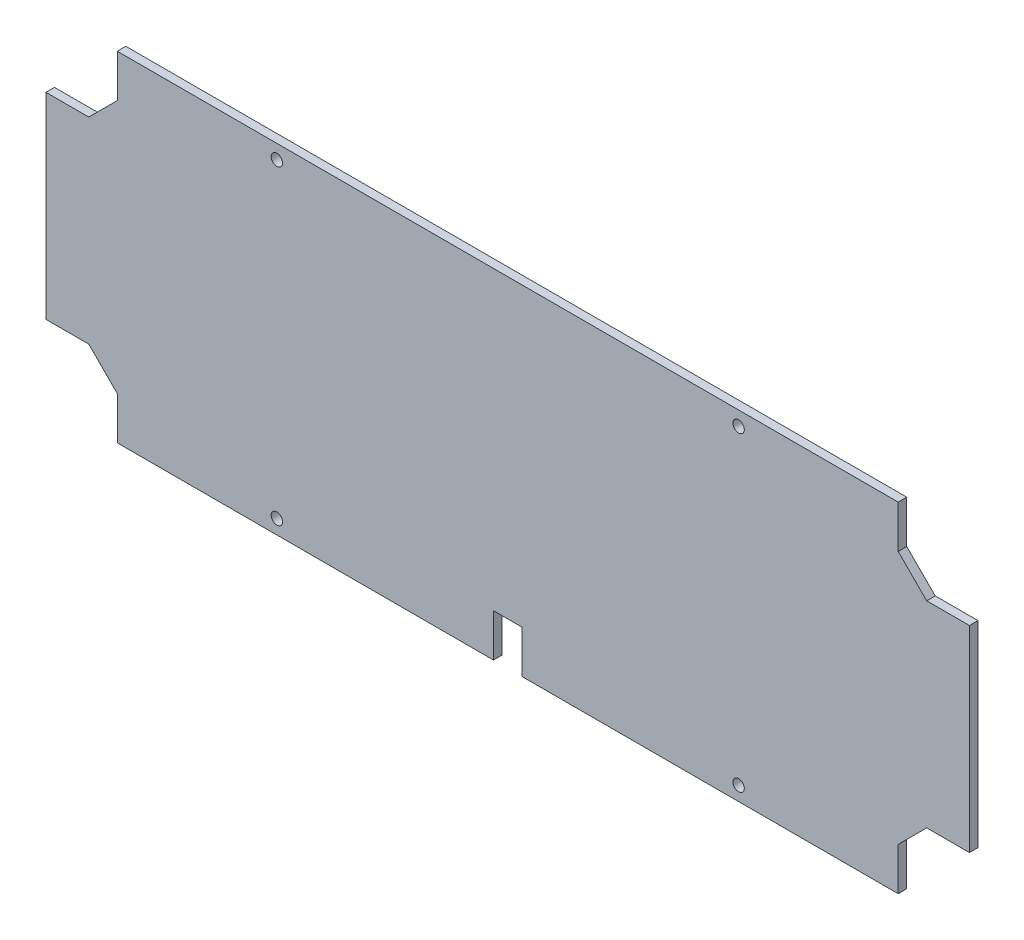
ISO-10303-21;
HEADER;
FILE_DESCRIPTION(('STEP AP214'),'2;1');
FILE_NAME('part.step','',(''),(''),'','','');
FILE_SCHEMA(('AUTOMOTIVE_DESIGN { 1 0 10303 214 1 1 1 1 }'));
ENDSEC;
DATA;
#1=APPLICATION_CONTEXT('core data for automotive mechanical design processes');
#2=APPLICATION_PROTOCOL_DEFINITION('international standard','automotive_design',2000,#1);
#3=PRODUCT_CONTEXT('',#1,'mechanical');
#4=PRODUCT('Part','Part','',(#3));
#5=PRODUCT_RELATED_PRODUCT_CATEGORY('part','',(#4));
#6=PRODUCT_DEFINITION_FORMATION('','',#4);
#7=PRODUCT_DEFINITION_CONTEXT('part definition',#1,'design');
#8=PRODUCT_DEFINITION('design','',#6,#7);
#9=PRODUCT_DEFINITION_SHAPE('','',#8);
#10=(LENGTH_UNIT() NAMED_UNIT(*) SI_UNIT(.MILLI.,.METRE.));
#11=(NAMED_UNIT(*) PLANE_ANGLE_UNIT() SI_UNIT($,.RADIAN.));
#12=(NAMED_UNIT(*) SI_UNIT($,.STERADIAN.) SOLID_ANGLE_UNIT());
#13=UNCERTAINTY_MEASURE_WITH_UNIT(LENGTH_MEASURE(1.E-05),#10,'distance_accuracy_value','');
#14=(GEOMETRIC_REPRESENTATION_CONTEXT(3) GLOBAL_UNCERTAINTY_ASSIGNED_CONTEXT((#13)) GLOBAL_UNIT_ASSIGNED_CONTEXT((#10,
#11,#12)) REPRESENTATION_CONTEXT('',''));
#15=CARTESIAN_POINT('',(0.,0.,0.));
#16=DIRECTION('',(0.,0.,1.));
#17=DIRECTION('',(1.,0.,0.));
#18=AXIS2_PLACEMENT_3D('',#15,#16,#17);
#19=CARTESIAN_POINT('',(0.,0.,3.));
#20=DIRECTION('',(0.,1.,0.));
#21=DIRECTION('',(0.,0.,1.));
#22=AXIS2_PLACEMENT_3D('',#19,#20,#21);
#23=PLANE('',#22);
#24=DIRECTION('',(1.,0.,0.));
#25=VECTOR('',#24,1.);
#26=CARTESIAN_POINT('',(0.,0.,3.));
#27=LINE('',#26,#25);
#28=CARTESIAN_POINT('',(167.,0.,3.));
#29=VERTEX_POINT('',#28);
#30=CARTESIAN_POINT('',(299.,0.,3.));
#31=VERTEX_POINT('',#30);
#32=EDGE_CURVE('E123',#29,#31,#27,.T.);
#33=ORIENTED_EDGE('',*,*,#32,.F.);
#34=DIRECTION('',(0.,0.,1.));
#35=VECTOR('',#34,1.);
#36=CARTESIAN_POINT('',(167.,0.,0.));
#37=LINE('',#36,#35);
#38=CARTESIAN_POINT('',(167.,0.,0.));
#39=VERTEX_POINT('',#38);
#40=EDGE_CURVE('E355',#39,#29,#37,.T.);
#41=ORIENTED_EDGE('',*,*,#40,.F.);
#42=DIRECTION('',(1.,0.,0.));
#43=VECTOR('',#42,1.);
#44=CARTESIAN_POINT('',(0.,0.,0.));
#45=LINE('',#44,#43);
#46=CARTESIAN_POINT('',(299.,0.,0.));
#47=VERTEX_POINT('',#46);
#48=EDGE_CURVE('E210',#39,#47,#45,.T.);
#49=ORIENTED_EDGE('',*,*,#48,.T.);
#50=DIRECTION('',(0.,0.,-1.));
#51=VECTOR('',#50,1.);
#52=CARTESIAN_POINT('',(299.,0.,3.));
#53=LINE('',#52,#51);
#54=EDGE_CURVE('E11',#31,#47,#53,.T.);
#55=ORIENTED_EDGE('',*,*,#54,.F.);
#56=EDGE_LOOP('',(#33,#41,#49,#55));
#57=FACE_BOUND('',#56,.T.);
#58=ADVANCED_FACE('F35',(#57),#23,.F.);
#59=CARTESIAN_POINT('',(25.,0.,0.));
#60=VERTEX_POINT('',#59);
#61=CARTESIAN_POINT('',(157.,0.,0.));
#62=VERTEX_POINT('',#61);
#63=EDGE_CURVE('E207',#60,#62,#45,.T.);
#64=ORIENTED_EDGE('',*,*,#63,.T.);
#65=DIRECTION('',(0.,0.,1.));
#66=VECTOR('',#65,1.);
#67=CARTESIAN_POINT('',(157.,0.,0.));
#68=LINE('',#67,#66);
#69=CARTESIAN_POINT('',(157.,0.,3.));
#70=VERTEX_POINT('',#69);
#71=EDGE_CURVE('E50',#62,#70,#68,.T.);
#72=ORIENTED_EDGE('',*,*,#71,.T.);
#73=CARTESIAN_POINT('',(25.,0.,3.));
#74=VERTEX_POINT('',#73);
#75=EDGE_CURVE('E314',#74,#70,#27,.T.);
#76=ORIENTED_EDGE('',*,*,#75,.F.);
#77=DIRECTION('',(0.,0.,-1.));
#78=VECTOR('',#77,1.);
#79=CARTESIAN_POINT('',(25.,0.,3.));
#80=LINE('',#79,#78);
#81=EDGE_CURVE('E59',#74,#60,#80,.T.);
#82=ORIENTED_EDGE('',*,*,#81,.T.);
#83=EDGE_LOOP('',(#64,#72,#76,#82));
#84=FACE_BOUND('',#83,.T.);
#85=ADVANCED_FACE('F37',(#84),#23,.F.);
#86=CARTESIAN_POINT('',(299.,1.10652228120974E-12,3.));
#87=DIRECTION('',(-1.,0.,0.));
#88=DIRECTION('',(0.,-1.,0.));
#89=AXIS2_PLACEMENT_3D('',#86,#87,#88);
#90=PLANE('',#89);
#91=DIRECTION('',(0.,1.,0.));
#92=VECTOR('',#91,1.);
#93=CARTESIAN_POINT('',(299.,1.10652228120974E-12,0.));
#94=LINE('',#93,#92);
#95=CARTESIAN_POINT('',(299.,14.9999999999999,0.));
#96=VERTEX_POINT('',#95);
#97=EDGE_CURVE('E209',#47,#96,#94,.T.);
#98=ORIENTED_EDGE('',*,*,#97,.T.);
#99=DIRECTION('',(0.,0.,-1.));
#100=VECTOR('',#99,1.);
#101=CARTESIAN_POINT('',(299.,14.9999999999999,3.));
#102=LINE('',#101,#100);
#103=CARTESIAN_POINT('',(299.,14.9999999999999,3.));
#104=VERTEX_POINT('',#103);
#105=EDGE_CURVE('E43',#104,#96,#102,.T.);
#106=ORIENTED_EDGE('',*,*,#105,.F.);
#107=DIRECTION('',(0.,1.,0.));
#108=VECTOR('',#107,1.);
#109=CARTESIAN_POINT('',(299.,1.10652228120974E-12,3.));
#110=LINE('',#109,#108);
#111=EDGE_CURVE('E310',#31,#104,#110,.T.);
#112=ORIENTED_EDGE('',*,*,#111,.F.);
#113=ORIENTED_EDGE('',*,*,#54,.T.);
#114=EDGE_LOOP('',(#98,#106,#112,#113));
#115=FACE_BOUND('',#114,.T.);
#116=ADVANCED_FACE('F295',(#115),#90,.F.);
#117=CARTESIAN_POINT('',(142.,-142.,3.));
#118=DIRECTION('',(0.707106781186547,-0.707106781186548,0.));
#119=DIRECTION('',(0.707106781186548,0.707106781186547,0.));
#120=AXIS2_PLACEMENT_3D('',#117,#118,#119);
#121=PLANE('',#120);
#122=DIRECTION('',(-0.707106781186548,-0.707106781186547,0.));
#123=VECTOR('',#122,1.);
#124=CARTESIAN_POINT('',(142.,-142.,0.));
#125=LINE('',#124,#123);
#126=CARTESIAN_POINT('',(309.,24.9999999999999,0.));
#127=VERTEX_POINT('',#126);
#128=EDGE_CURVE('E213',#127,#96,#125,.T.);
#129=ORIENTED_EDGE('',*,*,#128,.F.);
#130=DIRECTION('',(0.,0.,-1.));
#131=VECTOR('',#130,1.);
#132=CARTESIAN_POINT('',(309.,24.9999999999999,3.));
#133=LINE('',#132,#131);
#134=CARTESIAN_POINT('',(309.,24.9999999999999,3.));
#135=VERTEX_POINT('',#134);
#136=EDGE_CURVE('E285',#135,#127,#133,.T.);
#137=ORIENTED_EDGE('',*,*,#136,.F.);
#138=DIRECTION('',(-0.707106781186548,-0.707106781186547,0.));
#139=VECTOR('',#138,1.);
#140=CARTESIAN_POINT('',(142.,-142.,3.));
#141=LINE('',#140,#139);
#142=EDGE_CURVE('E292',#135,#104,#141,.T.);
#143=ORIENTED_EDGE('',*,*,#142,.T.);
#144=ORIENTED_EDGE('',*,*,#105,.T.);
#145=EDGE_LOOP('',(#129,#137,#143,#144));
#146=FACE_BOUND('',#145,.T.);
#147=ADVANCED_FACE('F290',(#146),#121,.T.);
#148=CARTESIAN_POINT('',(0.,25.0000000000002,3.));
#149=DIRECTION('',(0.,-1.,0.));
#150=DIRECTION('',(1.,0.,0.));
#151=AXIS2_PLACEMENT_3D('',#148,#149,#150);
#152=PLANE('',#151);
#153=DIRECTION('',(-1.,0.,0.));
#154=VECTOR('',#153,1.);
#155=CARTESIAN_POINT('',(0.,25.0000000000002,0.));
#156=LINE('',#155,#154);
#157=CARTESIAN_POINT('',(324.,24.9999999999999,0.));
#158=VERTEX_POINT('',#157);
#159=EDGE_CURVE('E216',#158,#127,#156,.T.);
#160=ORIENTED_EDGE('',*,*,#159,.F.);
#161=DIRECTION('',(0.,0.,-1.));
#162=VECTOR('',#161,1.);
#163=CARTESIAN_POINT('',(324.,24.9999999999999,3.));
#164=LINE('',#163,#162);
#165=CARTESIAN_POINT('',(324.,24.9999999999999,3.));
#166=VERTEX_POINT('',#165);
#167=EDGE_CURVE('E283',#166,#158,#164,.T.);
#168=ORIENTED_EDGE('',*,*,#167,.F.);
#169=DIRECTION('',(-1.,0.,0.));
#170=VECTOR('',#169,1.);
#171=CARTESIAN_POINT('',(0.,25.0000000000002,3.));
#172=LINE('',#171,#170);
#173=EDGE_CURVE('E309',#166,#135,#172,.T.);
#174=ORIENTED_EDGE('',*,*,#173,.T.);
#175=ORIENTED_EDGE('',*,*,#136,.T.);
#176=EDGE_LOOP('',(#160,#168,#174,#175));
#177=FACE_BOUND('',#176,.T.);
#178=ADVANCED_FACE('F305',(#177),#152,.T.);
#179=CARTESIAN_POINT('',(324.,0.,3.));
#180=DIRECTION('',(-1.,0.,0.));
#181=DIRECTION('',(0.,0.,1.));
#182=AXIS2_PLACEMENT_3D('',#179,#180,#181);
#183=PLANE('',#182);
#184=DIRECTION('',(0.,1.,0.));
#185=VECTOR('',#184,1.);
#186=CARTESIAN_POINT('',(324.,0.,0.));
#187=LINE('',#186,#185);
#188=CARTESIAN_POINT('',(324.,94.0000000000001,0.));
#189=VERTEX_POINT('',#188);
#190=EDGE_CURVE('E219',#158,#189,#187,.T.);
#191=ORIENTED_EDGE('',*,*,#190,.T.);
#192=DIRECTION('',(0.,0.,-1.));
#193=VECTOR('',#192,1.);
#194=CARTESIAN_POINT('',(324.,94.0000000000001,3.));
#195=LINE('',#194,#193);
#196=CARTESIAN_POINT('',(324.,94.0000000000001,3.));
#197=VERTEX_POINT('',#196);
#198=EDGE_CURVE('E280',#197,#189,#195,.T.);
#199=ORIENTED_EDGE('',*,*,#198,.F.);
#200=DIRECTION('',(0.,1.,0.));
#201=VECTOR('',#200,1.);
#202=CARTESIAN_POINT('',(324.,0.,3.));
#203=LINE('',#202,#201);
#204=EDGE_CURVE('E312',#166,#197,#203,.T.);
#205=ORIENTED_EDGE('',*,*,#204,.F.);
#206=ORIENTED_EDGE('',*,*,#167,.T.);
#207=EDGE_LOOP('',(#191,#199,#205,#206));
#208=FACE_BOUND('',#207,.T.);
#209=ADVANCED_FACE('F406',(#208),#183,.F.);
#210=CARTESIAN_POINT('',(0.,93.9999999999998,3.));
#211=DIRECTION('',(0.,-1.,0.));
#212=DIRECTION('',(1.,0.,0.));
#213=AXIS2_PLACEMENT_3D('',#210,#211,#212);
#214=PLANE('',#213);
#215=DIRECTION('',(-1.,0.,0.));
#216=VECTOR('',#215,1.);
#217=CARTESIAN_POINT('',(0.,93.9999999999998,0.));
#218=LINE('',#217,#216);
#219=CARTESIAN_POINT('',(309.,94.0000000000001,0.));
#220=VERTEX_POINT('',#219);
#221=EDGE_CURVE('E221',#189,#220,#218,.T.);
#222=ORIENTED_EDGE('',*,*,#221,.T.);
#223=DIRECTION('',(0.,0.,-1.));
#224=VECTOR('',#223,1.);
#225=CARTESIAN_POINT('',(309.,94.0000000000001,3.));
#226=LINE('',#225,#224);
#227=CARTESIAN_POINT('',(309.,94.0000000000001,3.));
#228=VERTEX_POINT('',#227);
#229=EDGE_CURVE('E277',#228,#220,#226,.T.);
#230=ORIENTED_EDGE('',*,*,#229,.F.);
#231=DIRECTION('',(-1.,0.,0.));
#232=VECTOR('',#231,1.);
#233=CARTESIAN_POINT('',(0.,93.9999999999998,3.));
#234=LINE('',#233,#232);
#235=EDGE_CURVE('E319',#197,#228,#234,.T.);
#236=ORIENTED_EDGE('',*,*,#235,.F.);
#237=ORIENTED_EDGE('',*,*,#198,.T.);
#238=EDGE_LOOP('',(#222,#230,#236,#237));
#239=FACE_BOUND('',#238,.T.);
#240=ADVANCED_FACE('F409',(#239),#214,.F.);
#241=CARTESIAN_POINT('',(201.5,201.5,3.));
#242=DIRECTION('',(-0.707106781186547,-0.707106781186548,0.));
#243=DIRECTION('',(0.707106781186548,-0.707106781186547,0.));
#244=AXIS2_PLACEMENT_3D('',#241,#242,#243);
#245=PLANE('',#244);
#246=DIRECTION('',(-0.707106781186548,0.707106781186547,0.));
#247=VECTOR('',#246,1.);
#248=CARTESIAN_POINT('',(201.5,201.5,0.));
#249=LINE('',#248,#247);
#250=CARTESIAN_POINT('',(299.,104.,0.));
#251=VERTEX_POINT('',#250);
#252=EDGE_CURVE('E223',#220,#251,#249,.T.);
#253=ORIENTED_EDGE('',*,*,#252,.T.);
#254=DIRECTION('',(0.,0.,-1.));
#255=VECTOR('',#254,1.);
#256=CARTESIAN_POINT('',(299.,104.,3.));
#257=LINE('',#256,#255);
#258=CARTESIAN_POINT('',(299.,104.,3.));
#259=VERTEX_POINT('',#258);
#260=EDGE_CURVE('E275',#259,#251,#257,.T.);
#261=ORIENTED_EDGE('',*,*,#260,.F.);
#262=DIRECTION('',(-0.707106781186548,0.707106781186547,0.));
#263=VECTOR('',#262,1.);
#264=CARTESIAN_POINT('',(201.5,201.5,3.));
#265=LINE('',#264,#263);
#266=EDGE_CURVE('E321',#228,#259,#265,.T.);
#267=ORIENTED_EDGE('',*,*,#266,.F.);
#268=ORIENTED_EDGE('',*,*,#229,.T.);
#269=EDGE_LOOP('',(#253,#261,#267,#268));
#270=FACE_BOUND('',#269,.T.);
#271=ADVANCED_FACE('F413',(#270),#245,.F.);
#272=CARTESIAN_POINT('',(299.,-1.10652228120974E-12,3.));
#273=DIRECTION('',(1.,0.,0.));
#274=DIRECTION('',(0.,1.,0.));
#275=AXIS2_PLACEMENT_3D('',#272,#273,#274);
#276=PLANE('',#275);
#277=DIRECTION('',(0.,-1.,0.));
#278=VECTOR('',#277,1.);
#279=CARTESIAN_POINT('',(299.,-1.10652228120974E-12,0.));
#280=LINE('',#279,#278);
#281=CARTESIAN_POINT('',(299.,119.,0.));
#282=VERTEX_POINT('',#281);
#283=EDGE_CURVE('E226',#282,#251,#280,.T.);
#284=ORIENTED_EDGE('',*,*,#283,.F.);
#285=DIRECTION('',(0.,0.,-1.));
#286=VECTOR('',#285,1.);
#287=CARTESIAN_POINT('',(299.,119.,3.));
#288=LINE('',#287,#286);
#289=CARTESIAN_POINT('',(299.,119.,3.));
#290=VERTEX_POINT('',#289);
#291=EDGE_CURVE('E273',#290,#282,#288,.T.);
#292=ORIENTED_EDGE('',*,*,#291,.F.);
#293=DIRECTION('',(0.,-1.,0.));
#294=VECTOR('',#293,1.);
#295=CARTESIAN_POINT('',(299.,-1.10652228120974E-12,3.));
#296=LINE('',#295,#294);
#297=EDGE_CURVE('E323',#290,#259,#296,.T.);
#298=ORIENTED_EDGE('',*,*,#297,.T.);
#299=ORIENTED_EDGE('',*,*,#260,.T.);
#300=EDGE_LOOP('',(#284,#292,#298,#299));
#301=FACE_BOUND('',#300,.T.);
#302=ADVANCED_FACE('F417',(#301),#276,.T.);
#303=CARTESIAN_POINT('',(0.,119.,3.));
#304=DIRECTION('',(0.,1.,0.));
#305=DIRECTION('',(0.,0.,1.));
#306=AXIS2_PLACEMENT_3D('',#303,#304,#305);
#307=PLANE('',#306);
#308=DIRECTION('',(1.,0.,0.));
#309=VECTOR('',#308,1.);
#310=CARTESIAN_POINT('',(0.,119.,0.));
#311=LINE('',#310,#309);
#312=CARTESIAN_POINT('',(25.,119.,0.));
#313=VERTEX_POINT('',#312);
#314=EDGE_CURVE('E229',#313,#282,#311,.T.);
#315=ORIENTED_EDGE('',*,*,#314,.F.);
#316=DIRECTION('',(0.,0.,-1.));
#317=VECTOR('',#316,1.);
#318=CARTESIAN_POINT('',(25.,119.,3.));
#319=LINE('',#318,#317);
#320=CARTESIAN_POINT('',(25.,119.,3.));
#321=VERTEX_POINT('',#320);
#322=EDGE_CURVE('E271',#321,#313,#319,.T.);
#323=ORIENTED_EDGE('',*,*,#322,.F.);
#324=DIRECTION('',(1.,0.,0.));
#325=VECTOR('',#324,1.);
#326=CARTESIAN_POINT('',(0.,119.,3.));
#327=LINE('',#326,#325);
#328=EDGE_CURVE('E326',#321,#290,#327,.T.);
#329=ORIENTED_EDGE('',*,*,#328,.T.);
#330=ORIENTED_EDGE('',*,*,#291,.T.);
#331=EDGE_LOOP('',(#315,#323,#329,#330));
#332=FACE_BOUND('',#331,.T.);
#333=ADVANCED_FACE('F421',(#332),#307,.T.);
#334=CARTESIAN_POINT('',(25.,0.,3.));
#335=DIRECTION('',(1.,0.,0.));
#336=DIRECTION('',(0.,1.,0.));
#337=AXIS2_PLACEMENT_3D('',#334,#335,#336);
#338=PLANE('',#337);
#339=DIRECTION('',(0.,-1.,0.));
#340=VECTOR('',#339,1.);
#341=CARTESIAN_POINT('',(25.,0.,0.));
#342=LINE('',#341,#340);
#343=CARTESIAN_POINT('',(25.,104.,0.));
#344=VERTEX_POINT('',#343);
#345=EDGE_CURVE('E232',#313,#344,#342,.T.);
#346=ORIENTED_EDGE('',*,*,#345,.T.);
#347=DIRECTION('',(0.,0.,-1.));
#348=VECTOR('',#347,1.);
#349=CARTESIAN_POINT('',(25.,104.,3.));
#350=LINE('',#349,#348);
#351=CARTESIAN_POINT('',(25.,104.,3.));
#352=VERTEX_POINT('',#351);
#353=EDGE_CURVE('E269',#352,#344,#350,.T.);
#354=ORIENTED_EDGE('',*,*,#353,.F.);
#355=DIRECTION('',(0.,-1.,0.));
#356=VECTOR('',#355,1.);
#357=CARTESIAN_POINT('',(25.,0.,3.));
#358=LINE('',#357,#356);
#359=EDGE_CURVE('E329',#321,#352,#358,.T.);
#360=ORIENTED_EDGE('',*,*,#359,.F.);
#361=ORIENTED_EDGE('',*,*,#322,.T.);
#362=EDGE_LOOP('',(#346,#354,#360,#361));
#363=FACE_BOUND('',#362,.T.);
#364=ADVANCED_FACE('F425',(#363),#338,.F.);
#365=CARTESIAN_POINT('',(-39.5,39.5,3.));
#366=DIRECTION('',(-0.707106781186547,0.707106781186548,0.));
#367=DIRECTION('',(-0.707106781186548,-0.707106781186547,0.));
#368=AXIS2_PLACEMENT_3D('',#365,#366,#367);
#369=PLANE('',#368);
#370=DIRECTION('',(0.707106781186548,0.707106781186547,0.));
#371=VECTOR('',#370,1.);
#372=CARTESIAN_POINT('',(-39.5,39.5,0.));
#373=LINE('',#372,#371);
#374=CARTESIAN_POINT('',(15.,94.,0.));
#375=VERTEX_POINT('',#374);
#376=EDGE_CURVE('E235',#375,#344,#373,.T.);
#377=ORIENTED_EDGE('',*,*,#376,.F.);
#378=DIRECTION('',(0.,0.,-1.));
#379=VECTOR('',#378,1.);
#380=CARTESIAN_POINT('',(15.,94.,3.));
#381=LINE('',#380,#379);
#382=CARTESIAN_POINT('',(15.,94.,3.));
#383=VERTEX_POINT('',#382);
#384=EDGE_CURVE('E267',#383,#375,#381,.T.);
#385=ORIENTED_EDGE('',*,*,#384,.F.);
#386=DIRECTION('',(0.707106781186548,0.707106781186547,0.));
#387=VECTOR('',#386,1.);
#388=CARTESIAN_POINT('',(-39.5,39.5,3.));
#389=LINE('',#388,#387);
#390=EDGE_CURVE('E331',#383,#352,#389,.T.);
#391=ORIENTED_EDGE('',*,*,#390,.T.);
#392=ORIENTED_EDGE('',*,*,#353,.T.);
#393=EDGE_LOOP('',(#377,#385,#391,#392));
#394=FACE_BOUND('',#393,.T.);
#395=ADVANCED_FACE('F429',(#394),#369,.T.);
#396=CARTESIAN_POINT('',(0.,94.,3.));
#397=DIRECTION('',(0.,1.,0.));
#398=DIRECTION('',(0.,0.,1.));
#399=AXIS2_PLACEMENT_3D('',#396,#397,#398);
#400=PLANE('',#399);
#401=DIRECTION('',(1.,0.,0.));
#402=VECTOR('',#401,1.);
#403=CARTESIAN_POINT('',(0.,94.,0.));
#404=LINE('',#403,#402);
#405=CARTESIAN_POINT('',(0.,94.,0.));
#406=VERTEX_POINT('',#405);
#407=EDGE_CURVE('E238',#406,#375,#404,.T.);
#408=ORIENTED_EDGE('',*,*,#407,.F.);
#409=DIRECTION('',(0.,0.,-1.));
#410=VECTOR('',#409,1.);
#411=CARTESIAN_POINT('',(0.,94.,3.));
#412=LINE('',#411,#410);
#413=CARTESIAN_POINT('',(0.,94.,3.));
#414=VERTEX_POINT('',#413);
#415=EDGE_CURVE('E265',#414,#406,#412,.T.);
#416=ORIENTED_EDGE('',*,*,#415,.F.);
#417=DIRECTION('',(1.,0.,0.));
#418=VECTOR('',#417,1.);
#419=CARTESIAN_POINT('',(0.,94.,3.));
#420=LINE('',#419,#418);
#421=EDGE_CURVE('E334',#414,#383,#420,.T.);
#422=ORIENTED_EDGE('',*,*,#421,.T.);
#423=ORIENTED_EDGE('',*,*,#384,.T.);
#424=EDGE_LOOP('',(#408,#416,#422,#423));
#425=FACE_BOUND('',#424,.T.);
#426=ADVANCED_FACE('F433',(#425),#400,.T.);
#427=CARTESIAN_POINT('',(0.,0.,3.));
#428=DIRECTION('',(-1.,0.,0.));
#429=DIRECTION('',(0.,-1.,0.));
#430=AXIS2_PLACEMENT_3D('',#427,#428,#429);
#431=PLANE('',#430);
#432=DIRECTION('',(0.,1.,0.));
#433=VECTOR('',#432,1.);
#434=CARTESIAN_POINT('',(0.,0.,0.));
#435=LINE('',#434,#433);
#436=CARTESIAN_POINT('',(0.,25.,0.));
#437=VERTEX_POINT('',#436);
#438=EDGE_CURVE('E241',#437,#406,#435,.T.);
#439=ORIENTED_EDGE('',*,*,#438,.F.);
#440=DIRECTION('',(0.,0.,-1.));
#441=VECTOR('',#440,1.);
#442=CARTESIAN_POINT('',(0.,25.,3.));
#443=LINE('',#442,#441);
#444=CARTESIAN_POINT('',(0.,25.,3.));
#445=VERTEX_POINT('',#444);
#446=EDGE_CURVE('E186',#445,#437,#443,.T.);
#447=ORIENTED_EDGE('',*,*,#446,.F.);
#448=DIRECTION('',(0.,1.,0.));
#449=VECTOR('',#448,1.);
#450=CARTESIAN_POINT('',(0.,0.,3.));
#451=LINE('',#450,#449);
#452=EDGE_CURVE('E175',#445,#414,#451,.T.);
#453=ORIENTED_EDGE('',*,*,#452,.T.);
#454=ORIENTED_EDGE('',*,*,#415,.T.);
#455=EDGE_LOOP('',(#439,#447,#453,#454));
#456=FACE_BOUND('',#455,.T.);
#457=ADVANCED_FACE('F338',(#456),#431,.T.);
#458=CARTESIAN_POINT('',(0.,25.,3.));
#459=DIRECTION('',(0.,1.,0.));
#460=DIRECTION('',(0.,0.,1.));
#461=AXIS2_PLACEMENT_3D('',#458,#459,#460);
#462=PLANE('',#461);
#463=DIRECTION('',(1.,0.,0.));
#464=VECTOR('',#463,1.);
#465=CARTESIAN_POINT('',(0.,25.,0.));
#466=LINE('',#465,#464);
#467=CARTESIAN_POINT('',(15.,25.,0.));
#468=VERTEX_POINT('',#467);
#469=EDGE_CURVE('E182',#437,#468,#466,.T.);
#470=ORIENTED_EDGE('',*,*,#469,.T.);
#471=DIRECTION('',(0.,0.,-1.));
#472=VECTOR('',#471,1.);
#473=CARTESIAN_POINT('',(15.,25.,3.));
#474=LINE('',#473,#472);
#475=CARTESIAN_POINT('',(15.,25.,3.));
#476=VERTEX_POINT('',#475);
#477=EDGE_CURVE('E179',#476,#468,#474,.T.);
#478=ORIENTED_EDGE('',*,*,#477,.F.);
#479=DIRECTION('',(1.,0.,0.));
#480=VECTOR('',#479,1.);
#481=CARTESIAN_POINT('',(0.,25.,3.));
#482=LINE('',#481,#480);
#483=EDGE_CURVE('E165',#445,#476,#482,.T.);
#484=ORIENTED_EDGE('',*,*,#483,.F.);
#485=ORIENTED_EDGE('',*,*,#446,.T.);
#486=EDGE_LOOP('',(#470,#478,#484,#485));
#487=FACE_BOUND('',#486,.T.);
#488=ADVANCED_FACE('F180',(#487),#462,.F.);
#489=CARTESIAN_POINT('',(20.,20.,3.));
#490=DIRECTION('',(0.707106781186547,0.707106781186548,0.));
#491=DIRECTION('',(-0.707106781186548,0.707106781186547,0.));
#492=AXIS2_PLACEMENT_3D('',#489,#490,#491);
#493=PLANE('',#492);
#494=DIRECTION('',(0.707106781186548,-0.707106781186547,0.));
#495=VECTOR('',#494,1.);
#496=CARTESIAN_POINT('',(20.,20.,0.));
#497=LINE('',#496,#495);
#498=CARTESIAN_POINT('',(25.,15.,0.));
#499=VERTEX_POINT('',#498);
#500=EDGE_CURVE('E245',#468,#499,#497,.T.);
#501=ORIENTED_EDGE('',*,*,#500,.T.);
#502=DIRECTION('',(0.,0.,-1.));
#503=VECTOR('',#502,1.);
#504=CARTESIAN_POINT('',(25.,15.,3.));
#505=LINE('',#504,#503);
#506=CARTESIAN_POINT('',(25.,15.,3.));
#507=VERTEX_POINT('',#506);
#508=EDGE_CURVE('E187',#507,#499,#505,.T.);
#509=ORIENTED_EDGE('',*,*,#508,.F.);
#510=DIRECTION('',(0.707106781186548,-0.707106781186547,0.));
#511=VECTOR('',#510,1.);
#512=CARTESIAN_POINT('',(20.,20.,3.));
#513=LINE('',#512,#511);
#514=EDGE_CURVE('E171',#476,#507,#513,.T.);
#515=ORIENTED_EDGE('',*,*,#514,.F.);
#516=ORIENTED_EDGE('',*,*,#477,.T.);
#517=EDGE_LOOP('',(#501,#509,#515,#516));
#518=FACE_BOUND('',#517,.T.);
#519=ADVANCED_FACE('F189',(#518),#493,.F.);
#520=CARTESIAN_POINT('',(81.,5.00000000000009,3.));
#521=DIRECTION('',(0.,0.,-1.));
#522=DIRECTION('',(-1.,0.,0.));
#523=AXIS2_PLACEMENT_3D('',#520,#521,#522);
#524=CYLINDRICAL_SURFACE('',#523,2.);
#525=CARTESIAN_POINT('',(81.,5.00000000000009,3.));
#526=DIRECTION('',(0.,0.,1.));
#527=DIRECTION('',(1.,0.,0.));
#528=AXIS2_PLACEMENT_3D('',#525,#526,#527);
#529=CIRCLE('',#528,2.);
#530=CARTESIAN_POINT('',(83.,5.00000000000009,3.));
#531=VERTEX_POINT('',#530);
#532=EDGE_CURVE('E201',#531,#531,#529,.F.);
#533=ORIENTED_EDGE('',*,*,#532,.F.);
#534=EDGE_LOOP('',(#533));
#535=FACE_BOUND('',#534,.T.);
#536=CARTESIAN_POINT('',(81.,5.00000000000009,0.));
#537=DIRECTION('',(0.,0.,1.));
#538=DIRECTION('',(1.,0.,0.));
#539=AXIS2_PLACEMENT_3D('',#536,#537,#538);
#540=CIRCLE('',#539,2.);
#541=CARTESIAN_POINT('',(83.,5.00000000000009,0.));
#542=VERTEX_POINT('',#541);
#543=EDGE_CURVE('E256',#542,#542,#540,.F.);
#544=ORIENTED_EDGE('',*,*,#543,.T.);
#545=EDGE_LOOP('',(#544));
#546=FACE_BOUND('',#545,.T.);
#547=ADVANCED_FACE('F444',(#535,#546),#524,.F.);
#548=CARTESIAN_POINT('',(81.,114.,3.));
#549=DIRECTION('',(0.,0.,-1.));
#550=DIRECTION('',(-1.,0.,0.));
#551=AXIS2_PLACEMENT_3D('',#548,#549,#550);
#552=CYLINDRICAL_SURFACE('',#551,2.);
#553=CARTESIAN_POINT('',(81.,114.,3.));
#554=DIRECTION('',(0.,0.,1.));
#555=DIRECTION('',(1.,0.,0.));
#556=AXIS2_PLACEMENT_3D('',#553,#554,#555);
#557=CIRCLE('',#556,2.);
#558=CARTESIAN_POINT('',(83.,114.,3.));
#559=VERTEX_POINT('',#558);
#560=EDGE_CURVE('E198',#559,#559,#557,.T.);
#561=ORIENTED_EDGE('',*,*,#560,.T.);
#562=EDGE_LOOP('',(#561));
#563=FACE_BOUND('',#562,.T.);
#564=CARTESIAN_POINT('',(81.,114.,0.));
#565=DIRECTION('',(0.,0.,1.));
#566=DIRECTION('',(1.,0.,0.));
#567=AXIS2_PLACEMENT_3D('',#564,#565,#566);
#568=CIRCLE('',#567,2.);
#569=CARTESIAN_POINT('',(83.,114.,0.));
#570=VERTEX_POINT('',#569);
#571=EDGE_CURVE('E253',#570,#570,#568,.T.);
#572=ORIENTED_EDGE('',*,*,#571,.F.);
#573=EDGE_LOOP('',(#572));
#574=FACE_BOUND('',#573,.T.);
#575=ADVANCED_FACE('F451',(#563,#574),#552,.F.);
#576=CARTESIAN_POINT('',(243.,114.,3.));
#577=DIRECTION('',(0.,0.,-1.));
#578=DIRECTION('',(-1.,0.,0.));
#579=AXIS2_PLACEMENT_3D('',#576,#577,#578);
#580=CYLINDRICAL_SURFACE('',#579,2.);
#581=CARTESIAN_POINT('',(243.,114.,3.));
#582=DIRECTION('',(0.,0.,1.));
#583=DIRECTION('',(1.,0.,0.));
#584=AXIS2_PLACEMENT_3D('',#581,#582,#583);
#585=CIRCLE('',#584,2.);
#586=CARTESIAN_POINT('',(245.,114.,3.));
#587=VERTEX_POINT('',#586);
#588=EDGE_CURVE('E192',#587,#587,#585,.T.);
#589=ORIENTED_EDGE('',*,*,#588,.T.);
#590=EDGE_LOOP('',(#589));
#591=FACE_BOUND('',#590,.T.);
#592=CARTESIAN_POINT('',(243.,114.,0.));
#593=DIRECTION('',(0.,0.,1.));
#594=DIRECTION('',(1.,0.,0.));
#595=AXIS2_PLACEMENT_3D('',#592,#593,#594);
#596=CIRCLE('',#595,2.);
#597=CARTESIAN_POINT('',(245.,114.,0.));
#598=VERTEX_POINT('',#597);
#599=EDGE_CURVE('E250',#598,#598,#596,.T.);
#600=ORIENTED_EDGE('',*,*,#599,.F.);
#601=EDGE_LOOP('',(#600));
#602=FACE_BOUND('',#601,.T.);
#603=ADVANCED_FACE('F448',(#591,#602),#580,.F.);
#604=CARTESIAN_POINT('',(25.,0.,3.));
#605=DIRECTION('',(-1.,0.,0.));
#606=DIRECTION('',(0.,-1.,0.));
#607=AXIS2_PLACEMENT_3D('',#604,#605,#606);
#608=PLANE('',#607);
#609=DIRECTION('',(0.,1.,0.));
#610=VECTOR('',#609,1.);
#611=CARTESIAN_POINT('',(25.,0.,0.));
#612=LINE('',#611,#610);
#613=EDGE_CURVE('E247',#60,#499,#612,.T.);
#614=ORIENTED_EDGE('',*,*,#613,.F.);
#615=ORIENTED_EDGE('',*,*,#81,.F.);
#616=DIRECTION('',(0.,1.,0.));
#617=VECTOR('',#616,1.);
#618=CARTESIAN_POINT('',(25.,0.,3.));
#619=LINE('',#618,#617);
#620=EDGE_CURVE('E190',#74,#507,#619,.T.);
#621=ORIENTED_EDGE('',*,*,#620,.T.);
#622=ORIENTED_EDGE('',*,*,#508,.T.);
#623=EDGE_LOOP('',(#614,#615,#621,#622));
#624=FACE_BOUND('',#623,.T.);
#625=ADVANCED_FACE('F340',(#624),#608,.T.);
#626=CARTESIAN_POINT('',(243.,5.00000000000009,3.));
#627=DIRECTION('',(0.,0.,-1.));
#628=DIRECTION('',(-1.,0.,0.));
#629=AXIS2_PLACEMENT_3D('',#626,#627,#628);
#630=CYLINDRICAL_SURFACE('',#629,2.);
#631=CARTESIAN_POINT('',(243.,5.00000000000009,3.));
#632=DIRECTION('',(0.,0.,1.));
#633=DIRECTION('',(1.,0.,0.));
#634=AXIS2_PLACEMENT_3D('',#631,#632,#633);
#635=CIRCLE('',#634,2.);
#636=CARTESIAN_POINT('',(245.,5.00000000000009,3.));
#637=VERTEX_POINT('',#636);
#638=EDGE_CURVE('E204',#637,#637,#635,.F.);
#639=ORIENTED_EDGE('',*,*,#638,.F.);
#640=EDGE_LOOP('',(#639));
#641=FACE_BOUND('',#640,.T.);
#642=CARTESIAN_POINT('',(243.,5.00000000000009,0.));
#643=DIRECTION('',(0.,0.,1.));
#644=DIRECTION('',(1.,0.,0.));
#645=AXIS2_PLACEMENT_3D('',#642,#643,#644);
#646=CIRCLE('',#645,2.);
#647=CARTESIAN_POINT('',(245.,5.00000000000009,0.));
#648=VERTEX_POINT('',#647);
#649=EDGE_CURVE('E259',#648,#648,#646,.F.);
#650=ORIENTED_EDGE('',*,*,#649,.T.);
#651=EDGE_LOOP('',(#650));
#652=FACE_BOUND('',#651,.T.);
#653=ADVANCED_FACE('F447',(#641,#652),#630,.F.);
#654=CARTESIAN_POINT('',(0.,0.,3.));
#655=DIRECTION('',(0.,0.,1.));
#656=DIRECTION('',(1.,0.,0.));
#657=AXIS2_PLACEMENT_3D('',#654,#655,#656);
#658=PLANE('',#657);
#659=DIRECTION('',(0.,1.,0.));
#660=VECTOR('',#659,1.);
#661=CARTESIAN_POINT('',(167.,0.,3.));
#662=LINE('',#661,#660);
#663=CARTESIAN_POINT('',(167.,15.,3.));
#664=VERTEX_POINT('',#663);
#665=EDGE_CURVE('E361',#29,#664,#662,.T.);
#666=ORIENTED_EDGE('',*,*,#665,.F.);
#667=ORIENTED_EDGE('',*,*,#32,.T.);
#668=ORIENTED_EDGE('',*,*,#111,.T.);
#669=ORIENTED_EDGE('',*,*,#142,.F.);
#670=ORIENTED_EDGE('',*,*,#173,.F.);
#671=ORIENTED_EDGE('',*,*,#204,.T.);
#672=ORIENTED_EDGE('',*,*,#235,.T.);
#673=ORIENTED_EDGE('',*,*,#266,.T.);
#674=ORIENTED_EDGE('',*,*,#297,.F.);
#675=ORIENTED_EDGE('',*,*,#328,.F.);
#676=ORIENTED_EDGE('',*,*,#359,.T.);
#677=ORIENTED_EDGE('',*,*,#390,.F.);
#678=ORIENTED_EDGE('',*,*,#421,.F.);
#679=ORIENTED_EDGE('',*,*,#452,.F.);
#680=ORIENTED_EDGE('',*,*,#483,.T.);
#681=ORIENTED_EDGE('',*,*,#514,.T.);
#682=ORIENTED_EDGE('',*,*,#620,.F.);
#683=ORIENTED_EDGE('',*,*,#75,.T.);
#684=DIRECTION('',(0.,-1.,0.));
#685=VECTOR('',#684,1.);
#686=CARTESIAN_POINT('',(157.,0.,3.));
#687=LINE('',#686,#685);
#688=CARTESIAN_POINT('',(157.,15.,3.));
#689=VERTEX_POINT('',#688);
#690=EDGE_CURVE('E346',#689,#70,#687,.T.);
#691=ORIENTED_EDGE('',*,*,#690,.F.);
#692=DIRECTION('',(-1.,0.,0.));
#693=VECTOR('',#692,1.);
#694=CARTESIAN_POINT('',(0.,15.,3.));
#695=LINE('',#694,#693);
#696=EDGE_CURVE('E366',#664,#689,#695,.T.);
#697=ORIENTED_EDGE('',*,*,#696,.F.);
#698=EDGE_LOOP('',(#666,#667,#668,#669,#670,#671,#672,#673,#674,#675,#676,#677,#678,#679,#680,
#681,#682,#683,#691,#697));
#699=FACE_BOUND('',#698,.T.);
#700=ORIENTED_EDGE('',*,*,#588,.F.);
#701=EDGE_LOOP('',(#700));
#702=FACE_BOUND('',#701,.T.);
#703=ORIENTED_EDGE('',*,*,#560,.F.);
#704=EDGE_LOOP('',(#703));
#705=FACE_BOUND('',#704,.T.);
#706=ORIENTED_EDGE('',*,*,#532,.T.);
#707=EDGE_LOOP('',(#706));
#708=FACE_BOUND('',#707,.T.);
#709=ORIENTED_EDGE('',*,*,#638,.T.);
#710=EDGE_LOOP('',(#709));
#711=FACE_BOUND('',#710,.T.);
#712=ADVANCED_FACE('F167',(#699,#702,#705,#708,#711),#658,.T.);
#713=CARTESIAN_POINT('',(0.,0.,0.));
#714=DIRECTION('',(0.,0.,1.));
#715=DIRECTION('',(1.,0.,0.));
#716=AXIS2_PLACEMENT_3D('',#713,#714,#715);
#717=PLANE('',#716);
#718=ORIENTED_EDGE('',*,*,#48,.F.);
#719=DIRECTION('',(0.,1.,0.));
#720=VECTOR('',#719,1.);
#721=CARTESIAN_POINT('',(167.,0.,0.));
#722=LINE('',#721,#720);
#723=CARTESIAN_POINT('',(167.,15.,0.));
#724=VERTEX_POINT('',#723);
#725=EDGE_CURVE('E353',#39,#724,#722,.T.);
#726=ORIENTED_EDGE('',*,*,#725,.T.);
#727=DIRECTION('',(-1.,0.,0.));
#728=VECTOR('',#727,1.);
#729=CARTESIAN_POINT('',(0.,15.,0.));
#730=LINE('',#729,#728);
#731=CARTESIAN_POINT('',(157.,15.,0.));
#732=VERTEX_POINT('',#731);
#733=EDGE_CURVE('E364',#724,#732,#730,.T.);
#734=ORIENTED_EDGE('',*,*,#733,.T.);
#735=DIRECTION('',(0.,-1.,0.));
#736=VECTOR('',#735,1.);
#737=CARTESIAN_POINT('',(157.,0.,0.));
#738=LINE('',#737,#736);
#739=EDGE_CURVE('E371',#732,#62,#738,.T.);
#740=ORIENTED_EDGE('',*,*,#739,.T.);
#741=ORIENTED_EDGE('',*,*,#63,.F.);
#742=ORIENTED_EDGE('',*,*,#613,.T.);
#743=ORIENTED_EDGE('',*,*,#500,.F.);
#744=ORIENTED_EDGE('',*,*,#469,.F.);
#745=ORIENTED_EDGE('',*,*,#438,.T.);
#746=ORIENTED_EDGE('',*,*,#407,.T.);
#747=ORIENTED_EDGE('',*,*,#376,.T.);
#748=ORIENTED_EDGE('',*,*,#345,.F.);
#749=ORIENTED_EDGE('',*,*,#314,.T.);
#750=ORIENTED_EDGE('',*,*,#283,.T.);
#751=ORIENTED_EDGE('',*,*,#252,.F.);
#752=ORIENTED_EDGE('',*,*,#221,.F.);
#753=ORIENTED_EDGE('',*,*,#190,.F.);
#754=ORIENTED_EDGE('',*,*,#159,.T.);
#755=ORIENTED_EDGE('',*,*,#128,.T.);
#756=ORIENTED_EDGE('',*,*,#97,.F.);
#757=EDGE_LOOP('',(#718,#726,#734,#740,#741,#742,#743,#744,#745,#746,#747,#748,#749,#750,#751,
#752,#753,#754,#755,#756));
#758=FACE_BOUND('',#757,.T.);
#759=ORIENTED_EDGE('',*,*,#599,.T.);
#760=EDGE_LOOP('',(#759));
#761=FACE_BOUND('',#760,.T.);
#762=ORIENTED_EDGE('',*,*,#571,.T.);
#763=EDGE_LOOP('',(#762));
#764=FACE_BOUND('',#763,.T.);
#765=ORIENTED_EDGE('',*,*,#543,.F.);
#766=EDGE_LOOP('',(#765));
#767=FACE_BOUND('',#766,.T.);
#768=ORIENTED_EDGE('',*,*,#649,.F.);
#769=EDGE_LOOP('',(#768));
#770=FACE_BOUND('',#769,.T.);
#771=ADVANCED_FACE('F299',(#758,#761,#764,#767,#770),#717,.F.);
#772=CARTESIAN_POINT('',(0.,15.,0.));
#773=DIRECTION('',(0.,1.,0.));
#774=DIRECTION('',(0.,0.,1.));
#775=AXIS2_PLACEMENT_3D('',#772,#773,#774);
#776=PLANE('',#775);
#777=ORIENTED_EDGE('',*,*,#696,.T.);
#778=DIRECTION('',(0.,0.,1.));
#779=VECTOR('',#778,1.);
#780=CARTESIAN_POINT('',(157.,15.,0.));
#781=LINE('',#780,#779);
#782=EDGE_CURVE('E350',#732,#689,#781,.T.);
#783=ORIENTED_EDGE('',*,*,#782,.F.);
#784=ORIENTED_EDGE('',*,*,#733,.F.);
#785=DIRECTION('',(0.,0.,1.));
#786=VECTOR('',#785,1.);
#787=CARTESIAN_POINT('',(167.,15.,0.));
#788=LINE('',#787,#786);
#789=EDGE_CURVE('E358',#724,#664,#788,.T.);
#790=ORIENTED_EDGE('',*,*,#789,.T.);
#791=EDGE_LOOP('',(#777,#783,#784,#790));
#792=FACE_BOUND('',#791,.T.);
#793=ADVANCED_FACE('F381',(#792),#776,.F.);
#794=CARTESIAN_POINT('',(167.,0.,0.));
#795=DIRECTION('',(1.,0.,0.));
#796=DIRECTION('',(0.,0.,-1.));
#797=AXIS2_PLACEMENT_3D('',#794,#795,#796);
#798=PLANE('',#797);
#799=ORIENTED_EDGE('',*,*,#665,.T.);
#800=ORIENTED_EDGE('',*,*,#789,.F.);
#801=ORIENTED_EDGE('',*,*,#725,.F.);
#802=ORIENTED_EDGE('',*,*,#40,.T.);
#803=EDGE_LOOP('',(#799,#800,#801,#802));
#804=FACE_BOUND('',#803,.T.);
#805=ADVANCED_FACE('F388',(#804),#798,.F.);
#806=CARTESIAN_POINT('',(157.,0.,0.));
#807=DIRECTION('',(-1.,0.,0.));
#808=DIRECTION('',(0.,0.,1.));
#809=AXIS2_PLACEMENT_3D('',#806,#807,#808);
#810=PLANE('',#809);
#811=ORIENTED_EDGE('',*,*,#690,.T.);
#812=ORIENTED_EDGE('',*,*,#71,.F.);
#813=ORIENTED_EDGE('',*,*,#739,.F.);
#814=ORIENTED_EDGE('',*,*,#782,.T.);
#815=EDGE_LOOP('',(#811,#812,#813,#814));
#816=FACE_BOUND('',#815,.T.);
#817=ADVANCED_FACE('F467',(#816),#810,.F.);
#818=CLOSED_SHELL('',(#58,#85,#116,#147,#178,#209,#240,#271,#302,#333,#364,#395,#426,#457,#488,
#519,#547,#575,#603,#625,#653,#712,#771,#793,#805,#817));
#819=MANIFOLD_SOLID_BREP('B2',#818);
#820=ADVANCED_BREP_SHAPE_REPRESENTATION('',(#18,#819),#14);
#821=SHAPE_DEFINITION_REPRESENTATION(#9,#820);
ENDSEC;
END-ISO-10303-21;
